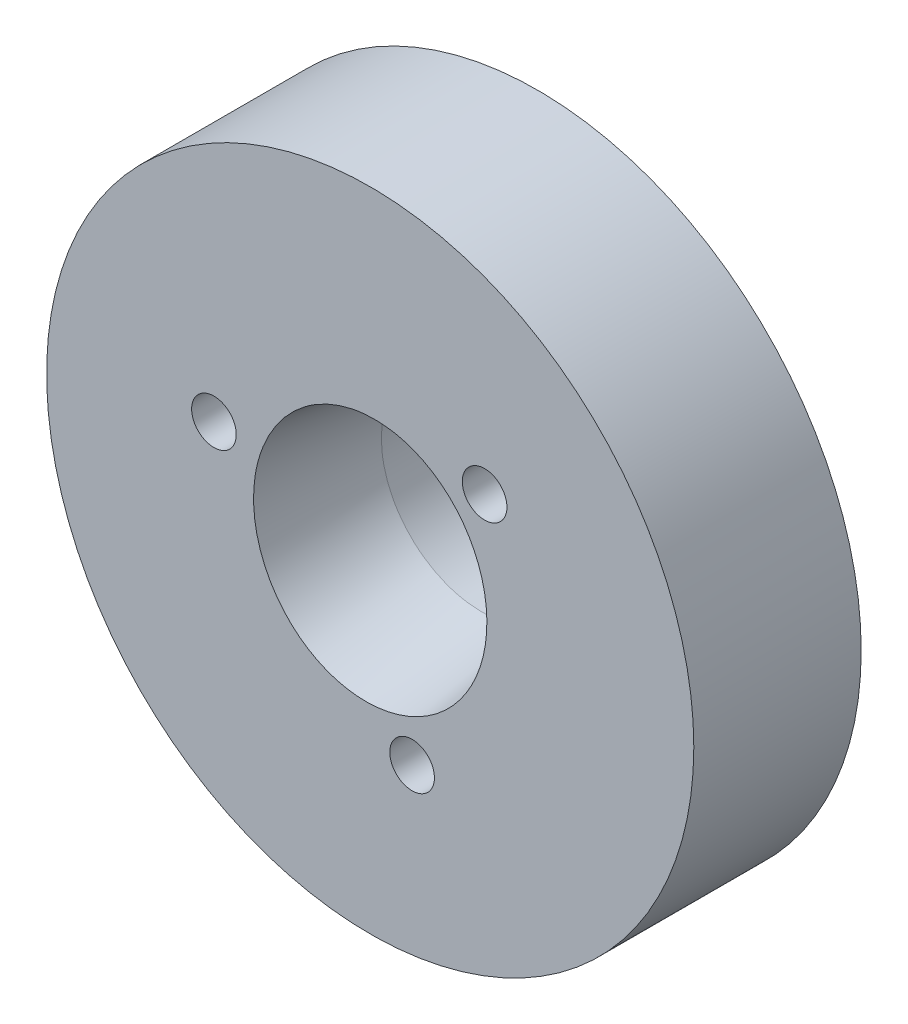
ISO-10303-21;
HEADER;
FILE_DESCRIPTION(('STEP AP214'),'2;1');
FILE_NAME('part.step','',(''),(''),'','','');
FILE_SCHEMA(('AUTOMOTIVE_DESIGN { 1 0 10303 214 1 1 1 1 }'));
ENDSEC;
DATA;
#1=APPLICATION_CONTEXT('core data for automotive mechanical design processes');
#2=APPLICATION_PROTOCOL_DEFINITION('international standard','automotive_design',2000,#1);
#3=PRODUCT_CONTEXT('',#1,'mechanical');
#4=PRODUCT('Part','Part','',(#3));
#5=PRODUCT_RELATED_PRODUCT_CATEGORY('part','',(#4));
#6=PRODUCT_DEFINITION_FORMATION('','',#4);
#7=PRODUCT_DEFINITION_CONTEXT('part definition',#1,'design');
#8=PRODUCT_DEFINITION('design','',#6,#7);
#9=PRODUCT_DEFINITION_SHAPE('','',#8);
#10=(LENGTH_UNIT() NAMED_UNIT(*) SI_UNIT(.MILLI.,.METRE.));
#11=(NAMED_UNIT(*) PLANE_ANGLE_UNIT() SI_UNIT($,.RADIAN.));
#12=(NAMED_UNIT(*) SI_UNIT($,.STERADIAN.) SOLID_ANGLE_UNIT());
#13=UNCERTAINTY_MEASURE_WITH_UNIT(LENGTH_MEASURE(1.E-05),#10,'distance_accuracy_value','');
#14=(GEOMETRIC_REPRESENTATION_CONTEXT(3) GLOBAL_UNCERTAINTY_ASSIGNED_CONTEXT((#13)) GLOBAL_UNIT_ASSIGNED_CONTEXT((#10,
#11,#12)) REPRESENTATION_CONTEXT('',''));
#15=CARTESIAN_POINT('',(0.,0.,0.));
#16=DIRECTION('',(0.,0.,1.));
#17=DIRECTION('',(1.,0.,0.));
#18=AXIS2_PLACEMENT_3D('',#15,#16,#17);
#19=CARTESIAN_POINT('',(0.,0.,10.));
#20=DIRECTION('',(0.,0.,-1.));
#21=DIRECTION('',(-1.,0.,0.));
#22=AXIS2_PLACEMENT_3D('',#19,#20,#21);
#23=CYLINDRICAL_SURFACE('',#22,29.);
#24=CARTESIAN_POINT('',(0.,0.,10.));
#25=DIRECTION('',(0.,0.,1.));
#26=DIRECTION('',(1.,0.,0.));
#27=AXIS2_PLACEMENT_3D('',#24,#25,#26);
#28=CIRCLE('',#27,29.);
#29=CARTESIAN_POINT('',(29.,0.,10.));
#30=VERTEX_POINT('',#29);
#31=EDGE_CURVE('E12',#30,#30,#28,.T.);
#32=ORIENTED_EDGE('',*,*,#31,.F.);
#33=EDGE_LOOP('',(#32));
#34=FACE_BOUND('',#33,.T.);
#35=CARTESIAN_POINT('',(0.,0.,-5.));
#36=DIRECTION('',(0.,0.,1.));
#37=DIRECTION('',(1.,0.,0.));
#38=AXIS2_PLACEMENT_3D('',#35,#36,#37);
#39=CIRCLE('',#38,29.);
#40=CARTESIAN_POINT('',(29.,0.,-5.));
#41=VERTEX_POINT('',#40);
#42=EDGE_CURVE('E210',#41,#41,#39,.T.);
#43=ORIENTED_EDGE('',*,*,#42,.T.);
#44=EDGE_LOOP('',(#43));
#45=FACE_BOUND('',#44,.T.);
#46=ADVANCED_FACE('F139',(#34,#45),#23,.T.);
#47=CARTESIAN_POINT('',(0.,0.,10.));
#48=DIRECTION('',(0.,0.,1.));
#49=DIRECTION('',(1.,0.,0.));
#50=AXIS2_PLACEMENT_3D('',#47,#48,#49);
#51=PLANE('',#50);
#52=CARTESIAN_POINT('',(-14.0059244811915,3.75287615398651,10.));
#53=DIRECTION('',(0.,0.,1.));
#54=DIRECTION('',(1.,0.,0.));
#55=AXIS2_PLACEMENT_3D('',#52,#53,#54);
#56=CIRCLE('',#55,2.);
#57=CARTESIAN_POINT('',(-12.0059244811915,3.75287615398651,10.));
#58=VERTEX_POINT('',#57);
#59=EDGE_CURVE('E201',#58,#58,#56,.T.);
#60=ORIENTED_EDGE('',*,*,#59,.F.);
#61=EDGE_LOOP('',(#60));
#62=FACE_BOUND('',#61,.T.);
#63=CARTESIAN_POINT('',(3.75287615398762,-14.0059244811912,10.));
#64=DIRECTION('',(0.,0.,1.));
#65=DIRECTION('',(1.,0.,0.));
#66=AXIS2_PLACEMENT_3D('',#63,#64,#65);
#67=CIRCLE('',#66,2.);
#68=CARTESIAN_POINT('',(5.75287615398762,-14.0059244811912,10.));
#69=VERTEX_POINT('',#68);
#70=EDGE_CURVE('E205',#69,#69,#67,.T.);
#71=ORIENTED_EDGE('',*,*,#70,.F.);
#72=EDGE_LOOP('',(#71));
#73=FACE_BOUND('',#72,.T.);
#74=CARTESIAN_POINT('',(10.2530483272052,10.253048327206,10.));
#75=DIRECTION('',(0.,0.,1.));
#76=DIRECTION('',(1.,0.,0.));
#77=AXIS2_PLACEMENT_3D('',#74,#75,#76);
#78=CIRCLE('',#77,2.);
#79=CARTESIAN_POINT('',(12.2530483272052,10.253048327206,10.));
#80=VERTEX_POINT('',#79);
#81=EDGE_CURVE('E208',#80,#80,#78,.T.);
#82=ORIENTED_EDGE('',*,*,#81,.F.);
#83=EDGE_LOOP('',(#82));
#84=FACE_BOUND('',#83,.T.);
#85=CARTESIAN_POINT('',(0.,0.,10.));
#86=DIRECTION('',(0.,0.,1.));
#87=DIRECTION('',(0.258819045102518,0.965925826289069,0.));
#88=AXIS2_PLACEMENT_3D('',#85,#86,#87);
#89=ELLIPSE('',#88,11.2,10.4);
#90=CARTESIAN_POINT('',(2.8987733051482,10.8183692544376,10.));
#91=VERTEX_POINT('',#90);
#92=EDGE_CURVE('E147',#91,#91,#89,.T.);
#93=ORIENTED_EDGE('',*,*,#92,.F.);
#94=EDGE_LOOP('',(#93));
#95=FACE_BOUND('',#94,.T.);
#96=ORIENTED_EDGE('',*,*,#31,.T.);
#97=EDGE_LOOP('',(#96));
#98=FACE_BOUND('',#97,.T.);
#99=ADVANCED_FACE('F158',(#62,#73,#84,#95,#98),#51,.T.);
#100=CARTESIAN_POINT('',(-8.69333243660162,2.32937140592266,0.));
#101=CARTESIAN_POINT('',(-8.91871512940239,2.38976251644661,1.66666666666667));
#102=CARTESIAN_POINT('',(-9.36948051500394,2.51054473749452,5.));
#103=CARTESIAN_POINT('',(-9.82024590060553,2.6313269585423,8.33333333333334));
#104=CARTESIAN_POINT('',(-10.0456285934063,2.69171806906619,10.));
#105=CARTESIAN_POINT('',(-8.99824643818213,1.19141686008505,0.));
#106=CARTESIAN_POINT('',(-9.23422756734219,1.21225406763538,1.66666666666667));
#107=CARTESIAN_POINT('',(-9.70618982566231,1.25392848273603,5.));
#108=CARTESIAN_POINT('',(-10.1764971985008,1.30177901453479,8.33333333333334));
#109=CARTESIAN_POINT('',(-10.41165088492,1.32570428043417,10.));
#110=CARTESIAN_POINT('',(-9.15585231968121,-1.20519428440477,0.));
#111=CARTESIAN_POINT('',(-9.40971293922637,-1.2645600494327,1.66666666666666));
#112=CARTESIAN_POINT('',(-9.91743417831671,-1.38329157948858,4.99999999999999));
#113=CARTESIAN_POINT('',(-10.4131685128769,-1.48511282443745,8.33333333333331));
#114=CARTESIAN_POINT('',(-10.661035680157,-1.53602344691188,9.99999999999997));
#115=CARTESIAN_POINT('',(-7.99725837748634,-4.61740234956153,0.));
#116=CARTESIAN_POINT('',(-8.25604439916644,-4.80826587599071,1.66666666666667));
#117=CARTESIAN_POINT('',(-8.77361644252663,-5.18999292884907,5.00000000000003));
#118=CARTESIAN_POINT('',(-9.25458268256608,-5.52476496894969,8.33333333333336));
#119=CARTESIAN_POINT('',(-9.4950658025858,-5.692150989,10.));
#120=CARTESIAN_POINT('',(-5.62173172428038,-7.32629729760369,0.));
#121=CARTESIAN_POINT('',(-5.83372250651816,-7.64384453084738,1.66666666666665));
#122=CARTESIAN_POINT('',(-6.25770407099374,-8.27893899733477,4.99999999999996));
#123=CARTESIAN_POINT('',(-6.6395155845352,-8.83116038899641,8.33333333333331));
#124=CARTESIAN_POINT('',(-6.83042134130593,-9.10727108482722,9.99999999999999));
#125=CARTESIAN_POINT('',(-2.39009806072031,-8.91996739768005,0.));
#126=CARTESIAN_POINT('',(-2.49539841913721,-9.3129536853471,1.66666666666668));
#127=CARTESIAN_POINT('',(-2.70599913597103,-10.0989262606812,5.00000000000004));
#128=CARTESIAN_POINT('',(-2.8895503031344,-10.7839485423236,8.33333333333336));
#129=CARTESIAN_POINT('',(-2.98132588671609,-11.1264596831448,10.));
#130=CARTESIAN_POINT('',(1.20541383768588,-9.15562543754226,0.));
#131=CARTESIAN_POINT('',(1.23022962385006,-9.53662479955168,1.66666666666666));
#132=CARTESIAN_POINT('',(1.27986119617842,-10.2986235235705,4.99999999999998));
#133=CARTESIAN_POINT('',(1.33440897053196,-10.9677670340334,8.33333333333332));
#134=CARTESIAN_POINT('',(1.36168285770873,-11.3023387892648,9.99999999999998));
#135=CARTESIAN_POINT('',(4.61712774075034,-7.99741692295741,0.));
#136=CARTESIAN_POINT('',(4.74581124645499,-8.292102596341,1.66666666666667));
#137=CARTESIAN_POINT('',(5.00317825786431,-8.88147394310818,5.00000000000002));
#138=CARTESIAN_POINT('',(5.25232122005093,-9.41187815433179,8.33333333333334));
#139=CARTESIAN_POINT('',(5.37689270114423,-9.6770802599436,10.));
#140=CARTESIAN_POINT('',(7.32660355994024,-5.62165502663093,0.));
#141=CARTESIAN_POINT('',(7.51677042297282,-5.79999759703284,1.66666666666666));
#142=CARTESIAN_POINT('',(7.89710414903798,-6.15668273783667,4.99999999999999));
#143=CARTESIAN_POINT('',(8.27551205382092,-6.49272968988738,8.33333333333333));
#144=CARTESIAN_POINT('',(8.46471600621239,-6.66075316591273,10.));
#145=CARTESIAN_POINT('',(8.3884184350211,-3.4673259517603,0.));
#146=CARTESIAN_POINT('',(8.6032026914626,-3.56727096525785,1.66666666666667));
#147=CARTESIAN_POINT('',(9.0327712043456,-3.76716099225294,5.));
#148=CARTESIAN_POINT('',(9.46399460271025,-3.96087490254981,8.33333333333334));
#149=CARTESIAN_POINT('',(9.67960630189258,-4.05773185769824,10.));
#150=CARTESIAN_POINT('',(8.99824643818213,-1.19141686008508,0.));
#151=CARTESIAN_POINT('',(9.23422756734219,-1.21225406763537,1.66666666666667));
#152=CARTESIAN_POINT('',(9.70618982566232,-1.25392848273596,5.));
#153=CARTESIAN_POINT('',(10.1764971985008,-1.30177901453479,8.33333333333334));
#154=CARTESIAN_POINT('',(10.41165088492,-1.32570428043421,10.));
#155=CARTESIAN_POINT('',(9.1558523196812,1.20519428440472,0.));
#156=CARTESIAN_POINT('',(9.40971293922636,1.2645600494327,1.66666666666666));
#157=CARTESIAN_POINT('',(9.91743417831669,1.38329157948867,5.));
#158=CARTESIAN_POINT('',(10.4131685128769,1.48511282443745,8.33333333333334));
#159=CARTESIAN_POINT('',(10.6610356801571,1.53602344691184,10.));
#160=CARTESIAN_POINT('',(7.99725837748637,4.61740234956154,0.));
#161=CARTESIAN_POINT('',(8.25604439916645,4.80826587599072,1.66666666666667));
#162=CARTESIAN_POINT('',(8.77361644252661,5.18999292884908,5.00000000000001));
#163=CARTESIAN_POINT('',(9.25458268256609,5.52476496894968,8.33333333333333));
#164=CARTESIAN_POINT('',(9.49506580258582,5.69215098899998,9.99999999999998));
#165=CARTESIAN_POINT('',(5.62173172428037,7.32629729760367,0.));
#166=CARTESIAN_POINT('',(5.83372250651816,7.64384453084738,1.66666666666666));
#167=CARTESIAN_POINT('',(6.25770407099372,8.27893899733482,4.99999999999999));
#168=CARTESIAN_POINT('',(6.6395155845352,8.83116038899641,8.33333333333334));
#169=CARTESIAN_POINT('',(6.83042134130593,9.10727108482721,10.));
#170=CARTESIAN_POINT('',(2.3900980607203,8.91996739768007,0.));
#171=CARTESIAN_POINT('',(2.49539841913721,9.31295368534709,1.66666666666668));
#172=CARTESIAN_POINT('',(2.70599913597102,10.0989262606812,5.00000000000003));
#173=CARTESIAN_POINT('',(2.8895503031344,10.7839485423236,8.33333333333334));
#174=CARTESIAN_POINT('',(2.9813258867161,11.1264596831449,9.99999999999999));
#175=CARTESIAN_POINT('',(-1.20541383768591,9.15562543754226,0.));
#176=CARTESIAN_POINT('',(-1.23022962385006,9.53662479955168,1.66666666666666));
#177=CARTESIAN_POINT('',(-1.27986119617837,10.2986235235705,4.99999999999999));
#178=CARTESIAN_POINT('',(-1.33440897053195,10.9677670340334,8.33333333333333));
#179=CARTESIAN_POINT('',(-1.36168285770874,11.3023387892648,10.));
#180=CARTESIAN_POINT('',(-4.61712774075036,7.99741692295739,0.));
#181=CARTESIAN_POINT('',(-4.74581124645499,8.29210259634099,1.66666666666667));
#182=CARTESIAN_POINT('',(-5.00317825786426,8.88147394310818,5.00000000000002));
#183=CARTESIAN_POINT('',(-5.25232122005091,9.41187815433181,8.33333333333334));
#184=CARTESIAN_POINT('',(-5.37689270114423,9.67708025994363,10.));
#185=CARTESIAN_POINT('',(-7.32660355994025,5.62165502663092,0.));
#186=CARTESIAN_POINT('',(-7.51677042297281,5.79999759703286,1.66666666666666));
#187=CARTESIAN_POINT('',(-7.89710414903793,6.15668273783674,4.99999999999999));
#188=CARTESIAN_POINT('',(-8.27551205382092,6.49272968988738,8.33333333333333));
#189=CARTESIAN_POINT('',(-8.46471600621241,6.66075316591269,10.));
#190=CARTESIAN_POINT('',(-8.38841843502111,3.46732595176027,0.));
#191=CARTESIAN_POINT('',(-8.6032026914626,3.56727096525785,1.66666666666667));
#192=CARTESIAN_POINT('',(-9.03277120434557,3.76716099225301,5.));
#193=CARTESIAN_POINT('',(-9.46399460271025,3.96087490254981,8.33333333333334));
#194=CARTESIAN_POINT('',(-9.67960630189259,4.05773185769821,10.));
#195=CARTESIAN_POINT('',(-8.69333243660162,2.32937140592266,0.));
#196=CARTESIAN_POINT('',(-8.91871512940239,2.38976251644661,1.66666666666667));
#197=CARTESIAN_POINT('',(-9.36948051500394,2.51054473749452,5.));
#198=CARTESIAN_POINT('',(-9.82024590060553,2.6313269585423,8.33333333333334));
#199=CARTESIAN_POINT('',(-10.0456285934063,2.69171806906619,10.));
#200=B_SPLINE_SURFACE_WITH_KNOTS('',3,3,((#100,#101,#102,#103,#104),(#105,#106,#107,#108,#109),
(#110,#111,#112,#113,#114),(#115,#116,#117,#118,#119),(#120,#121,#122,#123,#124),(#125,#126,
#127,#128,#129),(#130,#131,#132,#133,#134),(#135,#136,#137,#138,#139),(#140,#141,#142,#143,
#144),(#145,#146,#147,#148,#149),(#150,#151,#152,#153,#154),(#155,#156,#157,#158,#159),(#160,
#161,#162,#163,#164),(#165,#166,#167,#168,#169),(#170,#171,#172,#173,#174),(#175,#176,#177,#178,
#179),(#180,#181,#182,#183,#184),(#185,#186,#187,#188,#189),(#190,#191,#192,#193,#194),(#195,
#196,#197,#198,#199)),.UNSPECIFIED.,.T.,.F.,.F.,(4,1,1,1,1,1,1,1,2,1,1,1,1,1,1,1,4),(4,1,4),(0.,
0.0625,0.125,0.1875,0.25,0.3125,0.375,0.4375,0.5,0.5625,0.625,0.6875,0.75,0.8125,0.875,0.9375,
1.),(0.,0.5,1.),.UNSPECIFIED.);
#201=CARTESIAN_POINT('',(0.,0.,0.));
#202=DIRECTION('',(0.,0.,1.));
#203=DIRECTION('',(-0.965925826289069,0.258819045102518,0.));
#204=AXIS2_PLACEMENT_3D('',#201,#202,#203);
#205=ELLIPSE('',#204,9.,9.);
#206=CARTESIAN_POINT('',(-8.69333243660162,2.32937140592266,0.));
#207=VERTEX_POINT('',#206);
#208=EDGE_CURVE('E152',#207,#207,#205,.T.);
#209=ORIENTED_EDGE('',*,*,#208,.F.);
#210=EDGE_LOOP('',(#209));
#211=FACE_BOUND('',#210,.T.);
#212=ORIENTED_EDGE('',*,*,#92,.T.);
#213=EDGE_LOOP('',(#212));
#214=FACE_BOUND('',#213,.T.);
#215=ADVANCED_FACE('F161',(#211,#214),#200,.F.);
#216=CARTESIAN_POINT('',(10.2530483272052,10.253048327206,-0.0112868398370771));
#217=DIRECTION('',(0.,0.,1.));
#218=DIRECTION('',(1.,0.,0.));
#219=AXIS2_PLACEMENT_3D('',#216,#217,#218);
#220=CYLINDRICAL_SURFACE('',#219,2.);
#221=ORIENTED_EDGE('',*,*,#81,.T.);
#222=EDGE_LOOP('',(#221));
#223=FACE_BOUND('',#222,.T.);
#224=CARTESIAN_POINT('',(10.2530483272052,10.253048327206,-5.));
#225=DIRECTION('',(0.,0.,1.));
#226=DIRECTION('',(1.,0.,0.));
#227=AXIS2_PLACEMENT_3D('',#224,#225,#226);
#228=CIRCLE('',#227,2.);
#229=CARTESIAN_POINT('',(12.2530483272052,10.253048327206,-5.));
#230=VERTEX_POINT('',#229);
#231=EDGE_CURVE('E229',#230,#230,#228,.T.);
#232=ORIENTED_EDGE('',*,*,#231,.F.);
#233=EDGE_LOOP('',(#232));
#234=FACE_BOUND('',#233,.T.);
#235=ADVANCED_FACE('F182',(#223,#234),#220,.F.);
#236=CARTESIAN_POINT('',(3.75287615398762,-14.0059244811912,-0.0112868398370771));
#237=DIRECTION('',(0.,0.,1.));
#238=DIRECTION('',(1.,0.,0.));
#239=AXIS2_PLACEMENT_3D('',#236,#237,#238);
#240=CYLINDRICAL_SURFACE('',#239,2.);
#241=ORIENTED_EDGE('',*,*,#70,.T.);
#242=EDGE_LOOP('',(#241));
#243=FACE_BOUND('',#242,.T.);
#244=CARTESIAN_POINT('',(3.75287615398762,-14.0059244811912,-5.));
#245=DIRECTION('',(0.,0.,1.));
#246=DIRECTION('',(1.,0.,0.));
#247=AXIS2_PLACEMENT_3D('',#244,#245,#246);
#248=CIRCLE('',#247,2.);
#249=CARTESIAN_POINT('',(5.75287615398762,-14.0059244811912,-5.));
#250=VERTEX_POINT('',#249);
#251=EDGE_CURVE('E214',#250,#250,#248,.T.);
#252=ORIENTED_EDGE('',*,*,#251,.F.);
#253=EDGE_LOOP('',(#252));
#254=FACE_BOUND('',#253,.T.);
#255=ADVANCED_FACE('F248',(#243,#254),#240,.F.);
#256=CARTESIAN_POINT('',(-14.0059244811915,3.75287615398651,-0.0112868398370771));
#257=DIRECTION('',(0.,0.,1.));
#258=DIRECTION('',(1.,0.,0.));
#259=AXIS2_PLACEMENT_3D('',#256,#257,#258);
#260=CYLINDRICAL_SURFACE('',#259,2.);
#261=ORIENTED_EDGE('',*,*,#59,.T.);
#262=EDGE_LOOP('',(#261));
#263=FACE_BOUND('',#262,.T.);
#264=CARTESIAN_POINT('',(-14.0059244811915,3.75287615398651,-5.));
#265=DIRECTION('',(0.,0.,1.));
#266=DIRECTION('',(1.,0.,0.));
#267=AXIS2_PLACEMENT_3D('',#264,#265,#266);
#268=CIRCLE('',#267,2.);
#269=CARTESIAN_POINT('',(-12.0059244811915,3.75287615398651,-5.));
#270=VERTEX_POINT('',#269);
#271=EDGE_CURVE('E232',#270,#270,#268,.T.);
#272=ORIENTED_EDGE('',*,*,#271,.F.);
#273=EDGE_LOOP('',(#272));
#274=FACE_BOUND('',#273,.T.);
#275=ADVANCED_FACE('F245',(#263,#274),#260,.F.);
#276=CARTESIAN_POINT('',(0.,0.,-5.));
#277=DIRECTION('',(0.,0.,1.));
#278=DIRECTION('',(1.,0.,0.));
#279=AXIS2_PLACEMENT_3D('',#276,#277,#278);
#280=PLANE('',#279);
#281=CARTESIAN_POINT('',(0.,0.,-5.));
#282=DIRECTION('',(0.,0.,1.));
#283=DIRECTION('',(-0.965925826289069,0.258819045102518,0.));
#284=AXIS2_PLACEMENT_3D('',#281,#282,#283);
#285=ELLIPSE('',#284,9.,9.);
#286=CARTESIAN_POINT('',(-8.69333243660162,2.32937140592266,-5.));
#287=VERTEX_POINT('',#286);
#288=EDGE_CURVE('E235',#287,#287,#285,.T.);
#289=ORIENTED_EDGE('',*,*,#288,.T.);
#290=EDGE_LOOP('',(#289));
#291=FACE_BOUND('',#290,.T.);
#292=ORIENTED_EDGE('',*,*,#271,.T.);
#293=EDGE_LOOP('',(#292));
#294=FACE_BOUND('',#293,.T.);
#295=ORIENTED_EDGE('',*,*,#231,.T.);
#296=EDGE_LOOP('',(#295));
#297=FACE_BOUND('',#296,.T.);
#298=ORIENTED_EDGE('',*,*,#251,.T.);
#299=EDGE_LOOP('',(#298));
#300=FACE_BOUND('',#299,.T.);
#301=ORIENTED_EDGE('',*,*,#42,.F.);
#302=EDGE_LOOP('',(#301));
#303=FACE_BOUND('',#302,.T.);
#304=ADVANCED_FACE('F241',(#291,#294,#297,#300,#303),#280,.F.);
#305=DIRECTION('',(0.,0.,1.));
#306=VECTOR('',#305,1.);
#307=SURFACE_OF_LINEAR_EXTRUSION('',#285,#306);
#308=ORIENTED_EDGE('',*,*,#288,.F.);
#309=EDGE_LOOP('',(#308));
#310=FACE_BOUND('',#309,.T.);
#311=ORIENTED_EDGE('',*,*,#208,.T.);
#312=EDGE_LOOP('',(#311));
#313=FACE_BOUND('',#312,.T.);
#314=ADVANCED_FACE('F225',(#310,#313),#307,.F.);
#315=CLOSED_SHELL('',(#46,#99,#215,#235,#255,#275,#304,#314));
#316=MANIFOLD_SOLID_BREP('B2',#315);
#317=ADVANCED_BREP_SHAPE_REPRESENTATION('',(#18,#316),#14);
#318=SHAPE_DEFINITION_REPRESENTATION(#9,#317);
ENDSEC;
END-ISO-10303-21;
